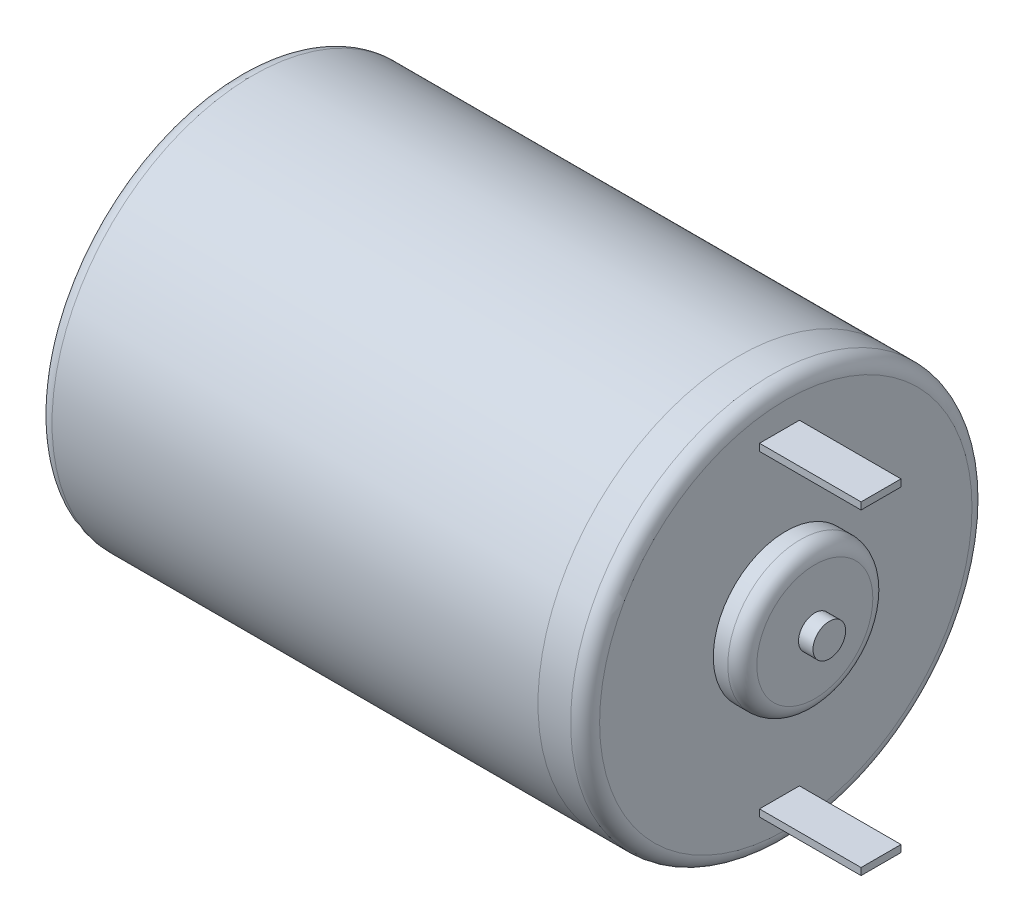
ISO-10303-21;
HEADER;
FILE_DESCRIPTION(('STEP AP214'),'2;1');
FILE_NAME('part.step','',(''),(''),'','','');
FILE_SCHEMA(('AUTOMOTIVE_DESIGN { 1 0 10303 214 1 1 1 1 }'));
ENDSEC;
DATA;
#1=APPLICATION_CONTEXT('core data for automotive mechanical design processes');
#2=APPLICATION_PROTOCOL_DEFINITION('international standard','automotive_design',2000,#1);
#3=PRODUCT_CONTEXT('',#1,'mechanical');
#4=PRODUCT('Part','Part','',(#3));
#5=PRODUCT_RELATED_PRODUCT_CATEGORY('part','',(#4));
#6=PRODUCT_DEFINITION_FORMATION('','',#4);
#7=PRODUCT_DEFINITION_CONTEXT('part definition',#1,'design');
#8=PRODUCT_DEFINITION('design','',#6,#7);
#9=PRODUCT_DEFINITION_SHAPE('','',#8);
#10=(LENGTH_UNIT() NAMED_UNIT(*) SI_UNIT(.MILLI.,.METRE.));
#11=(NAMED_UNIT(*) PLANE_ANGLE_UNIT() SI_UNIT($,.RADIAN.));
#12=(NAMED_UNIT(*) SI_UNIT($,.STERADIAN.) SOLID_ANGLE_UNIT());
#13=UNCERTAINTY_MEASURE_WITH_UNIT(LENGTH_MEASURE(1.E-05),#10,'distance_accuracy_value','');
#14=(GEOMETRIC_REPRESENTATION_CONTEXT(3) GLOBAL_UNCERTAINTY_ASSIGNED_CONTEXT((#13)) GLOBAL_UNIT_ASSIGNED_CONTEXT((#10,
#11,#12)) REPRESENTATION_CONTEXT('',''));
#15=CARTESIAN_POINT('',(0.,0.,0.));
#16=DIRECTION('',(0.,0.,1.));
#17=DIRECTION('',(1.,0.,0.));
#18=AXIS2_PLACEMENT_3D('',#15,#16,#17);
#19=CARTESIAN_POINT('',(37.75,0.,0.));
#20=DIRECTION('',(1.,0.,0.));
#21=DIRECTION('',(0.,0.,-1.));
#22=AXIS2_PLACEMENT_3D('',#19,#20,#21);
#23=PLANE('',#22);
#24=DIRECTION('',(0.,-1.,0.));
#25=VECTOR('',#24,1.);
#26=CARTESIAN_POINT('',(37.75,11.1568831968185,-0.938430110474201));
#27=LINE('',#26,#25);
#28=CARTESIAN_POINT('',(37.75,11.1568831968185,-0.938430110474201));
#29=VERTEX_POINT('',#28);
#30=CARTESIAN_POINT('',(37.75,10.6714166244686,-0.938430110474201));
#31=VERTEX_POINT('',#30);
#32=EDGE_CURVE('E112',#29,#31,#27,.T.);
#33=ORIENTED_EDGE('',*,*,#32,.T.);
#34=DIRECTION('',(0.,0.,1.));
#35=VECTOR('',#34,1.);
#36=CARTESIAN_POINT('',(37.75,10.6714166244686,-0.938430110474201));
#37=LINE('',#36,#35);
#38=CARTESIAN_POINT('',(37.75,10.6714166244686,1.8115698895258));
#39=VERTEX_POINT('',#38);
#40=EDGE_CURVE('E126',#31,#39,#37,.T.);
#41=ORIENTED_EDGE('',*,*,#40,.T.);
#42=DIRECTION('',(0.,1.,0.));
#43=VECTOR('',#42,1.);
#44=CARTESIAN_POINT('',(37.75,11.1568831968185,1.8115698895258));
#45=LINE('',#44,#43);
#46=CARTESIAN_POINT('',(37.75,11.1568831968185,1.8115698895258));
#47=VERTEX_POINT('',#46);
#48=EDGE_CURVE('E62',#39,#47,#45,.T.);
#49=ORIENTED_EDGE('',*,*,#48,.T.);
#50=DIRECTION('',(0.,0.,-1.));
#51=VECTOR('',#50,1.);
#52=CARTESIAN_POINT('',(37.75,11.1568831968185,-0.938430110474201));
#53=LINE('',#52,#51);
#54=EDGE_CURVE('E57',#47,#29,#53,.T.);
#55=ORIENTED_EDGE('',*,*,#54,.T.);
#56=EDGE_LOOP('',(#33,#41,#49,#55));
#57=FACE_BOUND('',#56,.T.);
#58=CARTESIAN_POINT('',(37.75,0.,0.));
#59=DIRECTION('',(1.,0.,0.));
#60=DIRECTION('',(0.,0.,-1.));
#61=AXIS2_PLACEMENT_3D('',#58,#59,#60);
#62=CIRCLE('',#61,12.835);
#63=CARTESIAN_POINT('',(37.75,0.,-12.835));
#64=VERTEX_POINT('',#63);
#65=EDGE_CURVE('E50',#64,#64,#62,.T.);
#66=ORIENTED_EDGE('',*,*,#65,.T.);
#67=EDGE_LOOP('',(#66));
#68=FACE_BOUND('',#67,.T.);
#69=CARTESIAN_POINT('',(37.75,0.,0.));
#70=DIRECTION('',(1.,0.,0.));
#71=DIRECTION('',(0.,0.,-1.));
#72=AXIS2_PLACEMENT_3D('',#69,#70,#71);
#73=CIRCLE('',#72,5.);
#74=CARTESIAN_POINT('',(37.75,0.,-5.));
#75=VERTEX_POINT('',#74);
#76=EDGE_CURVE('E176',#75,#75,#73,.T.);
#77=ORIENTED_EDGE('',*,*,#76,.F.);
#78=EDGE_LOOP('',(#77));
#79=FACE_BOUND('',#78,.T.);
#80=DIRECTION('',(0.,0.,1.));
#81=VECTOR('',#80,1.);
#82=CARTESIAN_POINT('',(37.75,-10.6714166244686,-0.938430110474201));
#83=LINE('',#82,#81);
#84=CARTESIAN_POINT('',(37.75,-10.6714166244686,-0.938430110474201));
#85=VERTEX_POINT('',#84);
#86=CARTESIAN_POINT('',(37.75,-10.6714166244686,1.8115698895258));
#87=VERTEX_POINT('',#86);
#88=EDGE_CURVE('E157',#85,#87,#83,.T.);
#89=ORIENTED_EDGE('',*,*,#88,.F.);
#90=DIRECTION('',(0.,1.,0.));
#91=VECTOR('',#90,1.);
#92=CARTESIAN_POINT('',(37.75,-11.1568831968185,-0.938430110474201));
#93=LINE('',#92,#91);
#94=CARTESIAN_POINT('',(37.75,-11.1568831968185,-0.938430110474201));
#95=VERTEX_POINT('',#94);
#96=EDGE_CURVE('E115',#95,#85,#93,.T.);
#97=ORIENTED_EDGE('',*,*,#96,.F.);
#98=DIRECTION('',(0.,0.,-1.));
#99=VECTOR('',#98,1.);
#100=CARTESIAN_POINT('',(37.75,-11.1568831968185,-0.938430110474201));
#101=LINE('',#100,#99);
#102=CARTESIAN_POINT('',(37.75,-11.1568831968185,1.8115698895258));
#103=VERTEX_POINT('',#102);
#104=EDGE_CURVE('E148',#103,#95,#101,.T.);
#105=ORIENTED_EDGE('',*,*,#104,.F.);
#106=DIRECTION('',(0.,-1.,0.));
#107=VECTOR('',#106,1.);
#108=CARTESIAN_POINT('',(37.75,-11.1568831968185,1.8115698895258));
#109=LINE('',#108,#107);
#110=EDGE_CURVE('E159',#87,#103,#109,.T.);
#111=ORIENTED_EDGE('',*,*,#110,.F.);
#112=EDGE_LOOP('',(#89,#97,#105,#111));
#113=FACE_BOUND('',#112,.T.);
#114=ADVANCED_FACE('F42',(#57,#68,#79,#113),#23,.T.);
#115=CARTESIAN_POINT('',(37.75,0.,0.));
#116=DIRECTION('',(-1.,0.,0.));
#117=DIRECTION('',(0.,0.,1.));
#118=AXIS2_PLACEMENT_3D('',#115,#116,#117);
#119=CYLINDRICAL_SURFACE('',#118,13.835);
#120=CARTESIAN_POINT('',(36.75,0.,0.));
#121=DIRECTION('',(1.,0.,0.));
#122=DIRECTION('',(0.,0.,-1.));
#123=AXIS2_PLACEMENT_3D('',#120,#121,#122);
#124=CIRCLE('',#123,13.835);
#125=CARTESIAN_POINT('',(36.75,0.,-13.835));
#126=VERTEX_POINT('',#125);
#127=EDGE_CURVE('E12',#126,#126,#124,.F.);
#128=ORIENTED_EDGE('',*,*,#127,.T.);
#129=EDGE_LOOP('',(#128));
#130=FACE_BOUND('',#129,.T.);
#131=CARTESIAN_POINT('',(34.5,0.,0.));
#132=DIRECTION('',(1.,0.,0.));
#133=DIRECTION('',(0.,0.,-1.));
#134=AXIS2_PLACEMENT_3D('',#131,#132,#133);
#135=CIRCLE('',#134,13.835);
#136=CARTESIAN_POINT('',(34.5,0.,-13.835));
#137=VERTEX_POINT('',#136);
#138=EDGE_CURVE('E181',#137,#137,#135,.T.);
#139=ORIENTED_EDGE('',*,*,#138,.T.);
#140=EDGE_LOOP('',(#139));
#141=FACE_BOUND('',#140,.T.);
#142=ADVANCED_FACE('F209',(#130,#141),#119,.T.);
#143=CARTESIAN_POINT('',(34.5,0.,0.));
#144=DIRECTION('',(1.,0.,0.));
#145=DIRECTION('',(0.,0.,-1.));
#146=AXIS2_PLACEMENT_3D('',#143,#144,#145);
#147=PLANE('',#146);
#148=ORIENTED_EDGE('',*,*,#138,.F.);
#149=EDGE_LOOP('',(#148));
#150=FACE_BOUND('',#149,.T.);
#151=ADVANCED_FACE('F214',(#150),#147,.F.);
#152=CARTESIAN_POINT('',(39.75,0.,0.));
#153=DIRECTION('',(-1.,0.,0.));
#154=DIRECTION('',(0.,0.,1.));
#155=AXIS2_PLACEMENT_3D('',#152,#153,#154);
#156=CYLINDRICAL_SURFACE('',#155,5.);
#157=CARTESIAN_POINT('',(38.75,0.,0.));
#158=DIRECTION('',(1.,0.,0.));
#159=DIRECTION('',(0.,0.,-1.));
#160=AXIS2_PLACEMENT_3D('',#157,#158,#159);
#161=CIRCLE('',#160,5.);
#162=CARTESIAN_POINT('',(38.75,0.,-5.));
#163=VERTEX_POINT('',#162);
#164=EDGE_CURVE('E187',#163,#163,#161,.F.);
#165=ORIENTED_EDGE('',*,*,#164,.T.);
#166=EDGE_LOOP('',(#165));
#167=FACE_BOUND('',#166,.T.);
#168=ORIENTED_EDGE('',*,*,#76,.T.);
#169=EDGE_LOOP('',(#168));
#170=FACE_BOUND('',#169,.T.);
#171=ADVANCED_FACE('F219',(#167,#170),#156,.T.);
#172=CARTESIAN_POINT('',(39.75,0.,0.));
#173=DIRECTION('',(1.,0.,0.));
#174=DIRECTION('',(0.,0.,-1.));
#175=AXIS2_PLACEMENT_3D('',#172,#173,#174);
#176=PLANE('',#175);
#177=CARTESIAN_POINT('',(39.75,0.,0.));
#178=DIRECTION('',(1.,0.,0.));
#179=DIRECTION('',(0.,0.,-1.));
#180=AXIS2_PLACEMENT_3D('',#177,#178,#179);
#181=CIRCLE('',#180,4.);
#182=CARTESIAN_POINT('',(39.75,0.,-4.));
#183=VERTEX_POINT('',#182);
#184=EDGE_CURVE('E184',#183,#183,#181,.T.);
#185=ORIENTED_EDGE('',*,*,#184,.T.);
#186=EDGE_LOOP('',(#185));
#187=FACE_BOUND('',#186,.T.);
#188=CARTESIAN_POINT('',(39.75,0.,0.));
#189=DIRECTION('',(1.,0.,0.));
#190=DIRECTION('',(0.,0.,-1.));
#191=AXIS2_PLACEMENT_3D('',#188,#189,#190);
#192=CIRCLE('',#191,1.125);
#193=CARTESIAN_POINT('',(39.75,0.,-1.125));
#194=VERTEX_POINT('',#193);
#195=EDGE_CURVE('E172',#194,#194,#192,.T.);
#196=ORIENTED_EDGE('',*,*,#195,.F.);
#197=EDGE_LOOP('',(#196));
#198=FACE_BOUND('',#197,.T.);
#199=ADVANCED_FACE('F226',(#187,#198),#176,.T.);
#200=CARTESIAN_POINT('',(40.75,0.,0.));
#201=DIRECTION('',(-1.,0.,0.));
#202=DIRECTION('',(0.,0.,1.));
#203=AXIS2_PLACEMENT_3D('',#200,#201,#202);
#204=CYLINDRICAL_SURFACE('',#203,1.125);
#205=CARTESIAN_POINT('',(40.75,0.,0.));
#206=DIRECTION('',(1.,0.,0.));
#207=DIRECTION('',(0.,0.,-1.));
#208=AXIS2_PLACEMENT_3D('',#205,#206,#207);
#209=CIRCLE('',#208,1.125);
#210=CARTESIAN_POINT('',(40.75,0.,-1.125));
#211=VERTEX_POINT('',#210);
#212=EDGE_CURVE('E173',#211,#211,#209,.T.);
#213=ORIENTED_EDGE('',*,*,#212,.F.);
#214=EDGE_LOOP('',(#213));
#215=FACE_BOUND('',#214,.T.);
#216=ORIENTED_EDGE('',*,*,#195,.T.);
#217=EDGE_LOOP('',(#216));
#218=FACE_BOUND('',#217,.T.);
#219=ADVANCED_FACE('F233',(#215,#218),#204,.T.);
#220=CARTESIAN_POINT('',(40.75,0.,0.));
#221=DIRECTION('',(1.,0.,0.));
#222=DIRECTION('',(0.,0.,-1.));
#223=AXIS2_PLACEMENT_3D('',#220,#221,#222);
#224=PLANE('',#223);
#225=ORIENTED_EDGE('',*,*,#212,.T.);
#226=EDGE_LOOP('',(#225));
#227=FACE_BOUND('',#226,.T.);
#228=ADVANCED_FACE('F205',(#227),#224,.T.);
#229=CARTESIAN_POINT('',(38.75,0.,0.));
#230=DIRECTION('',(1.,0.,0.));
#231=DIRECTION('',(0.,0.,-1.));
#232=AXIS2_PLACEMENT_3D('',#229,#230,#231);
#233=TOROIDAL_SURFACE('',#232,4.,1.);
#234=ORIENTED_EDGE('',*,*,#164,.F.);
#235=EDGE_LOOP('',(#234));
#236=FACE_BOUND('',#235,.T.);
#237=ORIENTED_EDGE('',*,*,#184,.F.);
#238=EDGE_LOOP('',(#237));
#239=FACE_BOUND('',#238,.T.);
#240=ADVANCED_FACE('F196',(#236,#239),#233,.T.);
#241=CARTESIAN_POINT('',(36.75,0.,0.));
#242=DIRECTION('',(1.,0.,0.));
#243=DIRECTION('',(0.,0.,-1.));
#244=AXIS2_PLACEMENT_3D('',#241,#242,#243);
#245=TOROIDAL_SURFACE('',#244,12.835,1.);
#246=ORIENTED_EDGE('',*,*,#127,.F.);
#247=EDGE_LOOP('',(#246));
#248=FACE_BOUND('',#247,.T.);
#249=ORIENTED_EDGE('',*,*,#65,.F.);
#250=EDGE_LOOP('',(#249));
#251=FACE_BOUND('',#250,.T.);
#252=ADVANCED_FACE('F44',(#248,#251),#245,.T.);
#253=CARTESIAN_POINT('',(44.75,-11.1568831968185,-0.938430110474201));
#254=DIRECTION('',(0.,0.,1.));
#255=DIRECTION('',(1.,0.,0.));
#256=AXIS2_PLACEMENT_3D('',#253,#254,#255);
#257=PLANE('',#256);
#258=ORIENTED_EDGE('',*,*,#96,.T.);
#259=DIRECTION('',(-1.,0.,0.));
#260=VECTOR('',#259,1.);
#261=CARTESIAN_POINT('',(44.75,-10.6714166244686,-0.938430110474201));
#262=LINE('',#261,#260);
#263=CARTESIAN_POINT('',(44.75,-10.6714166244686,-0.938430110474201));
#264=VERTEX_POINT('',#263);
#265=EDGE_CURVE('E170',#264,#85,#262,.T.);
#266=ORIENTED_EDGE('',*,*,#265,.F.);
#267=DIRECTION('',(0.,1.,0.));
#268=VECTOR('',#267,1.);
#269=CARTESIAN_POINT('',(44.75,-11.1568831968185,-0.938430110474201));
#270=LINE('',#269,#268);
#271=CARTESIAN_POINT('',(44.75,-11.1568831968185,-0.938430110474201));
#272=VERTEX_POINT('',#271);
#273=EDGE_CURVE('E144',#272,#264,#270,.T.);
#274=ORIENTED_EDGE('',*,*,#273,.F.);
#275=DIRECTION('',(-1.,0.,0.));
#276=VECTOR('',#275,1.);
#277=CARTESIAN_POINT('',(44.75,-11.1568831968185,-0.938430110474201));
#278=LINE('',#277,#276);
#279=EDGE_CURVE('E154',#272,#95,#278,.T.);
#280=ORIENTED_EDGE('',*,*,#279,.T.);
#281=EDGE_LOOP('',(#258,#266,#274,#280));
#282=FACE_BOUND('',#281,.T.);
#283=ADVANCED_FACE('F195',(#282),#257,.F.);
#284=CARTESIAN_POINT('',(44.75,-10.6714166244686,-0.938430110474201));
#285=DIRECTION('',(0.,-1.,0.));
#286=DIRECTION('',(0.,0.,-1.));
#287=AXIS2_PLACEMENT_3D('',#284,#285,#286);
#288=PLANE('',#287);
#289=ORIENTED_EDGE('',*,*,#88,.T.);
#290=DIRECTION('',(-1.,0.,0.));
#291=VECTOR('',#290,1.);
#292=CARTESIAN_POINT('',(44.75,-10.6714166244686,1.8115698895258));
#293=LINE('',#292,#291);
#294=CARTESIAN_POINT('',(44.75,-10.6714166244686,1.8115698895258));
#295=VERTEX_POINT('',#294);
#296=EDGE_CURVE('E167',#295,#87,#293,.T.);
#297=ORIENTED_EDGE('',*,*,#296,.F.);
#298=DIRECTION('',(0.,0.,1.));
#299=VECTOR('',#298,1.);
#300=CARTESIAN_POINT('',(44.75,-10.6714166244686,-0.938430110474201));
#301=LINE('',#300,#299);
#302=EDGE_CURVE('E147',#264,#295,#301,.T.);
#303=ORIENTED_EDGE('',*,*,#302,.F.);
#304=ORIENTED_EDGE('',*,*,#265,.T.);
#305=EDGE_LOOP('',(#289,#297,#303,#304));
#306=FACE_BOUND('',#305,.T.);
#307=ADVANCED_FACE('F202',(#306),#288,.F.);
#308=CARTESIAN_POINT('',(44.75,-11.1568831968185,1.8115698895258));
#309=DIRECTION('',(0.,0.,-1.));
#310=DIRECTION('',(-1.,0.,0.));
#311=AXIS2_PLACEMENT_3D('',#308,#309,#310);
#312=PLANE('',#311);
#313=ORIENTED_EDGE('',*,*,#110,.T.);
#314=DIRECTION('',(-1.,0.,0.));
#315=VECTOR('',#314,1.);
#316=CARTESIAN_POINT('',(44.75,-11.1568831968185,1.8115698895258));
#317=LINE('',#316,#315);
#318=CARTESIAN_POINT('',(44.75,-11.1568831968185,1.8115698895258));
#319=VERTEX_POINT('',#318);
#320=EDGE_CURVE('E165',#319,#103,#317,.T.);
#321=ORIENTED_EDGE('',*,*,#320,.F.);
#322=DIRECTION('',(0.,-1.,0.));
#323=VECTOR('',#322,1.);
#324=CARTESIAN_POINT('',(44.75,-11.1568831968185,1.8115698895258));
#325=LINE('',#324,#323);
#326=EDGE_CURVE('E150',#295,#319,#325,.T.);
#327=ORIENTED_EDGE('',*,*,#326,.F.);
#328=ORIENTED_EDGE('',*,*,#296,.T.);
#329=EDGE_LOOP('',(#313,#321,#327,#328));
#330=FACE_BOUND('',#329,.T.);
#331=ADVANCED_FACE('F248',(#330),#312,.F.);
#332=CARTESIAN_POINT('',(44.75,-11.1568831968185,-0.938430110474201));
#333=DIRECTION('',(0.,1.,0.));
#334=DIRECTION('',(0.,0.,1.));
#335=AXIS2_PLACEMENT_3D('',#332,#333,#334);
#336=PLANE('',#335);
#337=ORIENTED_EDGE('',*,*,#104,.T.);
#338=ORIENTED_EDGE('',*,*,#279,.F.);
#339=DIRECTION('',(0.,0.,-1.));
#340=VECTOR('',#339,1.);
#341=CARTESIAN_POINT('',(44.75,-11.1568831968185,-0.938430110474201));
#342=LINE('',#341,#340);
#343=EDGE_CURVE('E152',#319,#272,#342,.T.);
#344=ORIENTED_EDGE('',*,*,#343,.F.);
#345=ORIENTED_EDGE('',*,*,#320,.T.);
#346=EDGE_LOOP('',(#337,#338,#344,#345));
#347=FACE_BOUND('',#346,.T.);
#348=ADVANCED_FACE('F256',(#347),#336,.F.);
#349=CARTESIAN_POINT('',(44.75,0.,0.));
#350=DIRECTION('',(1.,0.,0.));
#351=DIRECTION('',(0.,0.,-1.));
#352=AXIS2_PLACEMENT_3D('',#349,#350,#351);
#353=PLANE('',#352);
#354=ORIENTED_EDGE('',*,*,#273,.T.);
#355=ORIENTED_EDGE('',*,*,#302,.T.);
#356=ORIENTED_EDGE('',*,*,#326,.T.);
#357=ORIENTED_EDGE('',*,*,#343,.T.);
#358=EDGE_LOOP('',(#354,#355,#356,#357));
#359=FACE_BOUND('',#358,.T.);
#360=ADVANCED_FACE('F252',(#359),#353,.T.);
#361=CARTESIAN_POINT('',(44.75,11.1568831968185,-0.938430110474201));
#362=DIRECTION('',(0.,0.,-1.));
#363=DIRECTION('',(-1.,0.,0.));
#364=AXIS2_PLACEMENT_3D('',#361,#362,#363);
#365=PLANE('',#364);
#366=ORIENTED_EDGE('',*,*,#32,.F.);
#367=DIRECTION('',(-1.,0.,0.));
#368=VECTOR('',#367,1.);
#369=CARTESIAN_POINT('',(44.75,11.1568831968185,-0.938430110474201));
#370=LINE('',#369,#368);
#371=CARTESIAN_POINT('',(44.75,11.1568831968185,-0.938430110474201));
#372=VERTEX_POINT('',#371);
#373=EDGE_CURVE('E106',#372,#29,#370,.T.);
#374=ORIENTED_EDGE('',*,*,#373,.F.);
#375=DIRECTION('',(0.,-1.,0.));
#376=VECTOR('',#375,1.);
#377=CARTESIAN_POINT('',(44.75,11.1568831968185,-0.938430110474201));
#378=LINE('',#377,#376);
#379=CARTESIAN_POINT('',(44.75,10.6714166244686,-0.938430110474201));
#380=VERTEX_POINT('',#379);
#381=EDGE_CURVE('E110',#372,#380,#378,.T.);
#382=ORIENTED_EDGE('',*,*,#381,.T.);
#383=DIRECTION('',(-1.,0.,0.));
#384=VECTOR('',#383,1.);
#385=CARTESIAN_POINT('',(44.75,10.6714166244686,-0.938430110474201));
#386=LINE('',#385,#384);
#387=EDGE_CURVE('E134',#380,#31,#386,.T.);
#388=ORIENTED_EDGE('',*,*,#387,.T.);
#389=EDGE_LOOP('',(#366,#374,#382,#388));
#390=FACE_BOUND('',#389,.T.);
#391=ADVANCED_FACE('F108',(#390),#365,.T.);
#392=CARTESIAN_POINT('',(44.75,11.1568831968185,-0.938430110474201));
#393=DIRECTION('',(0.,1.,0.));
#394=DIRECTION('',(0.,0.,1.));
#395=AXIS2_PLACEMENT_3D('',#392,#393,#394);
#396=PLANE('',#395);
#397=ORIENTED_EDGE('',*,*,#54,.F.);
#398=DIRECTION('',(-1.,0.,0.));
#399=VECTOR('',#398,1.);
#400=CARTESIAN_POINT('',(44.75,11.1568831968185,1.8115698895258));
#401=LINE('',#400,#399);
#402=CARTESIAN_POINT('',(44.75,11.1568831968185,1.8115698895258));
#403=VERTEX_POINT('',#402);
#404=EDGE_CURVE('E116',#403,#47,#401,.T.);
#405=ORIENTED_EDGE('',*,*,#404,.F.);
#406=DIRECTION('',(0.,0.,-1.));
#407=VECTOR('',#406,1.);
#408=CARTESIAN_POINT('',(44.75,11.1568831968185,-0.938430110474201));
#409=LINE('',#408,#407);
#410=EDGE_CURVE('E122',#403,#372,#409,.T.);
#411=ORIENTED_EDGE('',*,*,#410,.T.);
#412=ORIENTED_EDGE('',*,*,#373,.T.);
#413=EDGE_LOOP('',(#397,#405,#411,#412));
#414=FACE_BOUND('',#413,.T.);
#415=ADVANCED_FACE('F128',(#414),#396,.T.);
#416=CARTESIAN_POINT('',(44.75,11.1568831968185,1.8115698895258));
#417=DIRECTION('',(0.,0.,1.));
#418=DIRECTION('',(1.,0.,0.));
#419=AXIS2_PLACEMENT_3D('',#416,#417,#418);
#420=PLANE('',#419);
#421=ORIENTED_EDGE('',*,*,#48,.F.);
#422=DIRECTION('',(-1.,0.,0.));
#423=VECTOR('',#422,1.);
#424=CARTESIAN_POINT('',(44.75,10.6714166244686,1.8115698895258));
#425=LINE('',#424,#423);
#426=CARTESIAN_POINT('',(44.75,10.6714166244686,1.8115698895258));
#427=VERTEX_POINT('',#426);
#428=EDGE_CURVE('E140',#427,#39,#425,.T.);
#429=ORIENTED_EDGE('',*,*,#428,.F.);
#430=DIRECTION('',(0.,1.,0.));
#431=VECTOR('',#430,1.);
#432=CARTESIAN_POINT('',(44.75,11.1568831968185,1.8115698895258));
#433=LINE('',#432,#431);
#434=EDGE_CURVE('E129',#427,#403,#433,.T.);
#435=ORIENTED_EDGE('',*,*,#434,.T.);
#436=ORIENTED_EDGE('',*,*,#404,.T.);
#437=EDGE_LOOP('',(#421,#429,#435,#436));
#438=FACE_BOUND('',#437,.T.);
#439=ADVANCED_FACE('F348',(#438),#420,.T.);
#440=CARTESIAN_POINT('',(44.75,10.6714166244686,-0.938430110474201));
#441=DIRECTION('',(0.,-1.,0.));
#442=DIRECTION('',(0.,0.,-1.));
#443=AXIS2_PLACEMENT_3D('',#440,#441,#442);
#444=PLANE('',#443);
#445=ORIENTED_EDGE('',*,*,#40,.F.);
#446=ORIENTED_EDGE('',*,*,#387,.F.);
#447=DIRECTION('',(0.,0.,1.));
#448=VECTOR('',#447,1.);
#449=CARTESIAN_POINT('',(44.75,10.6714166244686,-0.938430110474201));
#450=LINE('',#449,#448);
#451=EDGE_CURVE('E125',#380,#427,#450,.T.);
#452=ORIENTED_EDGE('',*,*,#451,.T.);
#453=ORIENTED_EDGE('',*,*,#428,.T.);
#454=EDGE_LOOP('',(#445,#446,#452,#453));
#455=FACE_BOUND('',#454,.T.);
#456=ADVANCED_FACE('F359',(#455),#444,.T.);
#457=CARTESIAN_POINT('',(44.75,0.,0.));
#458=DIRECTION('',(1.,0.,0.));
#459=DIRECTION('',(0.,0.,-1.));
#460=AXIS2_PLACEMENT_3D('',#457,#458,#459);
#461=PLANE('',#460);
#462=ORIENTED_EDGE('',*,*,#381,.F.);
#463=ORIENTED_EDGE('',*,*,#410,.F.);
#464=ORIENTED_EDGE('',*,*,#434,.F.);
#465=ORIENTED_EDGE('',*,*,#451,.F.);
#466=EDGE_LOOP('',(#462,#463,#464,#465));
#467=FACE_BOUND('',#466,.T.);
#468=ADVANCED_FACE('F120',(#467),#461,.T.);
#469=CLOSED_SHELL('',(#114,#142,#151,#171,#199,#219,#228,#240,#252,#283,#307,#331,#348,#360,
#391,#415,#439,#456,#468));
#470=MANIFOLD_SOLID_BREP('B2',#469);
#471=CARTESIAN_POINT('',(34.5,0.,0.));
#472=DIRECTION('',(-1.,0.,0.));
#473=DIRECTION('',(0.,0.,1.));
#474=AXIS2_PLACEMENT_3D('',#471,#472,#473);
#475=CYLINDRICAL_SURFACE('',#474,13.835);
#476=CARTESIAN_POINT('',(1.,0.,0.));
#477=DIRECTION('',(1.,0.,0.));
#478=DIRECTION('',(0.,0.,-1.));
#479=AXIS2_PLACEMENT_3D('',#476,#477,#478);
#480=CIRCLE('',#479,13.835);
#481=CARTESIAN_POINT('',(1.,0.,-13.835));
#482=VERTEX_POINT('',#481);
#483=EDGE_CURVE('E417',#482,#482,#480,.T.);
#484=ORIENTED_EDGE('',*,*,#483,.T.);
#485=EDGE_LOOP('',(#484));
#486=FACE_BOUND('',#485,.T.);
#487=CARTESIAN_POINT('',(34.5,0.,0.));
#488=DIRECTION('',(1.,0.,0.));
#489=DIRECTION('',(0.,0.,-1.));
#490=AXIS2_PLACEMENT_3D('',#487,#488,#489);
#491=CIRCLE('',#490,13.835);
#492=CARTESIAN_POINT('',(34.5,0.,-13.835));
#493=VERTEX_POINT('',#492);
#494=EDGE_CURVE('E421',#493,#493,#491,.T.);
#495=ORIENTED_EDGE('',*,*,#494,.F.);
#496=EDGE_LOOP('',(#495));
#497=FACE_BOUND('',#496,.T.);
#498=ADVANCED_FACE('F410',(#486,#497),#475,.T.);
#499=CARTESIAN_POINT('',(34.5,0.,0.));
#500=DIRECTION('',(1.,0.,0.));
#501=DIRECTION('',(0.,0.,-1.));
#502=AXIS2_PLACEMENT_3D('',#499,#500,#501);
#503=PLANE('',#502);
#504=ORIENTED_EDGE('',*,*,#494,.T.);
#505=EDGE_LOOP('',(#504));
#506=FACE_BOUND('',#505,.T.);
#507=ADVANCED_FACE('F428',(#506),#503,.T.);
#508=CARTESIAN_POINT('',(0.,0.,0.));
#509=DIRECTION('',(1.,0.,0.));
#510=DIRECTION('',(0.,0.,-1.));
#511=AXIS2_PLACEMENT_3D('',#508,#509,#510);
#512=PLANE('',#511);
#513=CARTESIAN_POINT('',(0.,0.,0.));
#514=DIRECTION('',(1.,0.,0.));
#515=DIRECTION('',(0.,0.,-1.));
#516=AXIS2_PLACEMENT_3D('',#513,#514,#515);
#517=CIRCLE('',#516,12.835);
#518=CARTESIAN_POINT('',(0.,0.,-12.835));
#519=VERTEX_POINT('',#518);
#520=EDGE_CURVE('E41',#519,#519,#517,.F.);
#521=ORIENTED_EDGE('',*,*,#520,.T.);
#522=EDGE_LOOP('',(#521));
#523=FACE_BOUND('',#522,.T.);
#524=ADVANCED_FACE('F434',(#523),#512,.F.);
#525=CARTESIAN_POINT('',(1.,0.,0.));
#526=DIRECTION('',(1.,0.,0.));
#527=DIRECTION('',(0.,0.,-1.));
#528=AXIS2_PLACEMENT_3D('',#525,#526,#527);
#529=TOROIDAL_SURFACE('',#528,12.835,1.);
#530=ORIENTED_EDGE('',*,*,#520,.F.);
#531=EDGE_LOOP('',(#530));
#532=FACE_BOUND('',#531,.T.);
#533=ORIENTED_EDGE('',*,*,#483,.F.);
#534=EDGE_LOOP('',(#533));
#535=FACE_BOUND('',#534,.T.);
#536=ADVANCED_FACE('F412',(#532,#535),#529,.T.);
#537=CLOSED_SHELL('',(#498,#507,#524,#536));
#538=MANIFOLD_SOLID_BREP('B6',#537);
#539=ADVANCED_BREP_SHAPE_REPRESENTATION('',(#18,#470,#538),#14);
#540=SHAPE_DEFINITION_REPRESENTATION(#9,#539);
ENDSEC;
END-ISO-10303-21;
